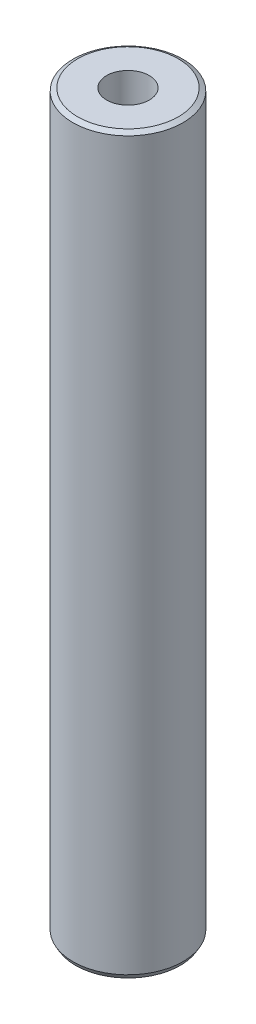
ISO-10303-21;
HEADER;
FILE_DESCRIPTION(('STEP AP214'),'2;1');
FILE_NAME('part.step','',(''),(''),'','','');
FILE_SCHEMA(('AUTOMOTIVE_DESIGN { 1 0 10303 214 1 1 1 1 }'));
ENDSEC;
DATA;
#1=APPLICATION_CONTEXT('core data for automotive mechanical design processes');
#2=APPLICATION_PROTOCOL_DEFINITION('international standard','automotive_design',2000,#1);
#3=PRODUCT_CONTEXT('',#1,'mechanical');
#4=PRODUCT('Part','Part','',(#3));
#5=PRODUCT_RELATED_PRODUCT_CATEGORY('part','',(#4));
#6=PRODUCT_DEFINITION_FORMATION('','',#4);
#7=PRODUCT_DEFINITION_CONTEXT('part definition',#1,'design');
#8=PRODUCT_DEFINITION('design','',#6,#7);
#9=PRODUCT_DEFINITION_SHAPE('','',#8);
#10=(LENGTH_UNIT() NAMED_UNIT(*) SI_UNIT(.MILLI.,.METRE.));
#11=(NAMED_UNIT(*) PLANE_ANGLE_UNIT() SI_UNIT($,.RADIAN.));
#12=(NAMED_UNIT(*) SI_UNIT($,.STERADIAN.) SOLID_ANGLE_UNIT());
#13=UNCERTAINTY_MEASURE_WITH_UNIT(LENGTH_MEASURE(1.E-05),#10,'distance_accuracy_value','');
#14=(GEOMETRIC_REPRESENTATION_CONTEXT(3) GLOBAL_UNCERTAINTY_ASSIGNED_CONTEXT((#13)) GLOBAL_UNIT_ASSIGNED_CONTEXT((#10,
#11,#12)) REPRESENTATION_CONTEXT('',''));
#15=CARTESIAN_POINT('',(0.,0.,0.));
#16=DIRECTION('',(0.,0.,1.));
#17=DIRECTION('',(1.,0.,0.));
#18=AXIS2_PLACEMENT_3D('',#15,#16,#17);
#19=CARTESIAN_POINT('',(0.,600.,0.));
#20=DIRECTION('',(0.,-1.,0.));
#21=DIRECTION('',(0.,0.,-1.));
#22=AXIS2_PLACEMENT_3D('',#19,#20,#21);
#23=CYLINDRICAL_SURFACE('',#22,45.);
#24=CARTESIAN_POINT('',(0.,597.776698673141,0.));
#25=DIRECTION('',(0.,1.,0.));
#26=DIRECTION('',(0.,0.,1.));
#27=AXIS2_PLACEMENT_3D('',#24,#25,#26);
#28=CIRCLE('',#27,45.);
#29=CARTESIAN_POINT('',(0.,597.776698673141,45.));
#30=VERTEX_POINT('',#29);
#31=EDGE_CURVE('E50',#30,#30,#28,.F.);
#32=ORIENTED_EDGE('',*,*,#31,.T.);
#33=EDGE_LOOP('',(#32));
#34=FACE_BOUND('',#33,.T.);
#35=CARTESIAN_POINT('',(0.,3.85087085865488,0.));
#36=DIRECTION('',(0.,1.,0.));
#37=DIRECTION('',(0.,0.,1.));
#38=AXIS2_PLACEMENT_3D('',#35,#36,#37);
#39=CIRCLE('',#38,45.);
#40=CARTESIAN_POINT('',(0.,3.85087085865488,45.));
#41=VERTEX_POINT('',#40);
#42=EDGE_CURVE('E51',#41,#41,#39,.T.);
#43=ORIENTED_EDGE('',*,*,#42,.T.);
#44=EDGE_LOOP('',(#43));
#45=FACE_BOUND('',#44,.T.);
#46=ADVANCED_FACE('F39',(#34,#45),#23,.T.);
#47=CARTESIAN_POINT('',(0.,600.,0.));
#48=DIRECTION('',(0.,1.,0.));
#49=DIRECTION('',(0.,0.,1.));
#50=AXIS2_PLACEMENT_3D('',#47,#48,#49);
#51=PLANE('',#50);
#52=CARTESIAN_POINT('',(0.,600.,0.));
#53=DIRECTION('',(0.,1.,0.));
#54=DIRECTION('',(0.,0.,1.));
#55=AXIS2_PLACEMENT_3D('',#52,#53,#54);
#56=CIRCLE('',#55,41.1491291413453);
#57=CARTESIAN_POINT('',(0.,600.,41.1491291413453));
#58=VERTEX_POINT('',#57);
#59=EDGE_CURVE('E54',#58,#58,#56,.T.);
#60=ORIENTED_EDGE('',*,*,#59,.T.);
#61=EDGE_LOOP('',(#60));
#62=FACE_BOUND('',#61,.T.);
#63=CARTESIAN_POINT('',(0.,600.,0.));
#64=DIRECTION('',(0.,1.,0.));
#65=DIRECTION('',(0.,0.,1.));
#66=AXIS2_PLACEMENT_3D('',#63,#64,#65);
#67=CIRCLE('',#66,17.4137680042161);
#68=CARTESIAN_POINT('',(0.,600.,17.4137680042161));
#69=VERTEX_POINT('',#68);
#70=EDGE_CURVE('E58',#69,#69,#67,.T.);
#71=ORIENTED_EDGE('',*,*,#70,.F.);
#72=EDGE_LOOP('',(#71));
#73=FACE_BOUND('',#72,.T.);
#74=ADVANCED_FACE('F69',(#62,#73),#51,.T.);
#75=CARTESIAN_POINT('',(0.,0.,0.));
#76=DIRECTION('',(0.,1.,0.));
#77=DIRECTION('',(0.,0.,1.));
#78=AXIS2_PLACEMENT_3D('',#75,#76,#77);
#79=PLANE('',#78);
#80=CARTESIAN_POINT('',(0.,0.,0.));
#81=DIRECTION('',(0.,1.,0.));
#82=DIRECTION('',(0.,0.,1.));
#83=AXIS2_PLACEMENT_3D('',#80,#81,#82);
#84=CIRCLE('',#83,42.7766986731411);
#85=CARTESIAN_POINT('',(0.,0.,42.7766986731411));
#86=VERTEX_POINT('',#85);
#87=EDGE_CURVE('E10',#86,#86,#84,.F.);
#88=ORIENTED_EDGE('',*,*,#87,.T.);
#89=EDGE_LOOP('',(#88));
#90=FACE_BOUND('',#89,.T.);
#91=CARTESIAN_POINT('',(0.,0.,0.));
#92=DIRECTION('',(0.,1.,0.));
#93=DIRECTION('',(0.,0.,1.));
#94=AXIS2_PLACEMENT_3D('',#91,#92,#93);
#95=CIRCLE('',#94,17.4137680042161);
#96=CARTESIAN_POINT('',(0.,0.,17.4137680042161));
#97=VERTEX_POINT('',#96);
#98=EDGE_CURVE('E63',#97,#97,#95,.T.);
#99=ORIENTED_EDGE('',*,*,#98,.T.);
#100=EDGE_LOOP('',(#99));
#101=FACE_BOUND('',#100,.T.);
#102=ADVANCED_FACE('F75',(#90,#101),#79,.F.);
#103=CARTESIAN_POINT('',(0.,600.,0.));
#104=DIRECTION('',(0.,-1.,0.));
#105=DIRECTION('',(0.,0.,-1.));
#106=AXIS2_PLACEMENT_3D('',#103,#104,#105);
#107=CYLINDRICAL_SURFACE('',#106,17.4137680042161);
#108=ORIENTED_EDGE('',*,*,#70,.T.);
#109=EDGE_LOOP('',(#108));
#110=FACE_BOUND('',#109,.T.);
#111=ORIENTED_EDGE('',*,*,#98,.F.);
#112=EDGE_LOOP('',(#111));
#113=FACE_BOUND('',#112,.T.);
#114=ADVANCED_FACE('F70',(#110,#113),#107,.F.);
#115=CARTESIAN_POINT('',(0.,600.,0.));
#116=DIRECTION('',(0.,-1.,0.));
#117=DIRECTION('',(0.,0.,-1.));
#118=AXIS2_PLACEMENT_3D('',#115,#116,#117);
#119=CONICAL_SURFACE('',#118,41.1491291413453,1.04719755119658);
#120=ORIENTED_EDGE('',*,*,#31,.F.);
#121=EDGE_LOOP('',(#120));
#122=FACE_BOUND('',#121,.T.);
#123=ORIENTED_EDGE('',*,*,#59,.F.);
#124=EDGE_LOOP('',(#123));
#125=FACE_BOUND('',#124,.T.);
#126=ADVANCED_FACE('F81',(#122,#125),#119,.T.);
#127=CARTESIAN_POINT('',(0.,3.85087085865488,0.));
#128=DIRECTION('',(0.,1.,0.));
#129=DIRECTION('',(0.,0.,1.));
#130=AXIS2_PLACEMENT_3D('',#127,#128,#129);
#131=CONICAL_SURFACE('',#130,45.,0.523598775598304);
#132=ORIENTED_EDGE('',*,*,#87,.F.);
#133=EDGE_LOOP('',(#132));
#134=FACE_BOUND('',#133,.T.);
#135=ORIENTED_EDGE('',*,*,#42,.F.);
#136=EDGE_LOOP('',(#135));
#137=FACE_BOUND('',#136,.T.);
#138=ADVANCED_FACE('F45',(#134,#137),#131,.T.);
#139=CLOSED_SHELL('',(#46,#74,#102,#114,#126,#138));
#140=MANIFOLD_SOLID_BREP('B2',#139);
#141=ADVANCED_BREP_SHAPE_REPRESENTATION('',(#18,#140),#14);
#142=SHAPE_DEFINITION_REPRESENTATION(#9,#141);
ENDSEC;
END-ISO-10303-21;
